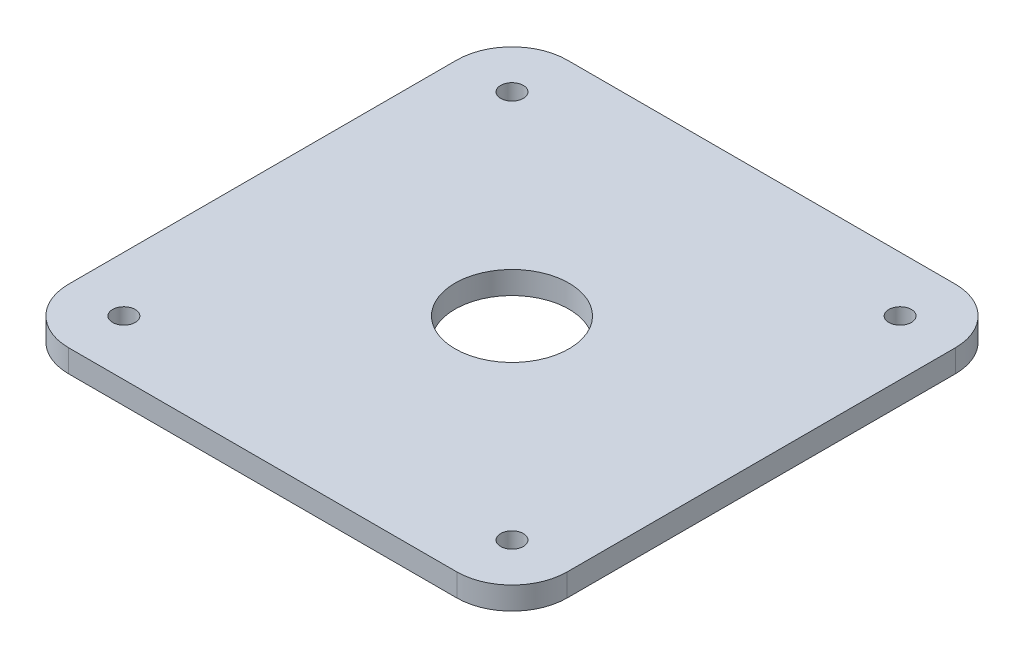
ISO-10303-21;
HEADER;
FILE_DESCRIPTION(('STEP AP214'),'2;1');
FILE_NAME('part.step','',(''),(''),'','','');
FILE_SCHEMA(('AUTOMOTIVE_DESIGN { 1 0 10303 214 1 1 1 1 }'));
ENDSEC;
DATA;
#1=APPLICATION_CONTEXT('core data for automotive mechanical design processes');
#2=APPLICATION_PROTOCOL_DEFINITION('international standard','automotive_design',2000,#1);
#3=PRODUCT_CONTEXT('',#1,'mechanical');
#4=PRODUCT('Part','Part','',(#3));
#5=PRODUCT_RELATED_PRODUCT_CATEGORY('part','',(#4));
#6=PRODUCT_DEFINITION_FORMATION('','',#4);
#7=PRODUCT_DEFINITION_CONTEXT('part definition',#1,'design');
#8=PRODUCT_DEFINITION('design','',#6,#7);
#9=PRODUCT_DEFINITION_SHAPE('','',#8);
#10=(LENGTH_UNIT() NAMED_UNIT(*) SI_UNIT(.MILLI.,.METRE.));
#11=(NAMED_UNIT(*) PLANE_ANGLE_UNIT() SI_UNIT($,.RADIAN.));
#12=(NAMED_UNIT(*) SI_UNIT($,.STERADIAN.) SOLID_ANGLE_UNIT());
#13=UNCERTAINTY_MEASURE_WITH_UNIT(LENGTH_MEASURE(1.E-05),#10,'distance_accuracy_value','');
#14=(GEOMETRIC_REPRESENTATION_CONTEXT(3) GLOBAL_UNCERTAINTY_ASSIGNED_CONTEXT((#13)) GLOBAL_UNIT_ASSIGNED_CONTEXT((#10,
#11,#12)) REPRESENTATION_CONTEXT('',''));
#15=CARTESIAN_POINT('',(0.,0.,0.));
#16=DIRECTION('',(0.,0.,1.));
#17=DIRECTION('',(1.,0.,0.));
#18=AXIS2_PLACEMENT_3D('',#15,#16,#17);
#19=CARTESIAN_POINT('',(109.,12.7,109.));
#20=DIRECTION('',(0.,1.,0.));
#21=DIRECTION('',(0.,0.,1.));
#22=AXIS2_PLACEMENT_3D('',#19,#20,#21);
#23=PLANE('',#22);
#24=CARTESIAN_POINT('',(109.,12.7,109.));
#25=DIRECTION('',(0.,1.,0.));
#26=DIRECTION('',(0.,0.,1.));
#27=AXIS2_PLACEMENT_3D('',#24,#25,#26);
#28=CIRCLE('',#27,6.34999999999999);
#29=CARTESIAN_POINT('',(109.,12.7,115.35));
#30=VERTEX_POINT('',#29);
#31=EDGE_CURVE('E194',#30,#30,#28,.T.);
#32=ORIENTED_EDGE('',*,*,#31,.F.);
#33=EDGE_LOOP('',(#32));
#34=FACE_BOUND('',#33,.T.);
#35=CARTESIAN_POINT('',(-109.,12.7,-109.));
#36=DIRECTION('',(0.,1.,0.));
#37=DIRECTION('',(0.,0.,1.));
#38=AXIS2_PLACEMENT_3D('',#35,#36,#37);
#39=CIRCLE('',#38,6.34999999999999);
#40=CARTESIAN_POINT('',(-109.,12.7,-102.65));
#41=VERTEX_POINT('',#40);
#42=EDGE_CURVE('E182',#41,#41,#39,.T.);
#43=ORIENTED_EDGE('',*,*,#42,.F.);
#44=EDGE_LOOP('',(#43));
#45=FACE_BOUND('',#44,.T.);
#46=CARTESIAN_POINT('',(109.,12.7,109.));
#47=DIRECTION('',(0.,1.,0.));
#48=DIRECTION('',(0.,0.,1.));
#49=AXIS2_PLACEMENT_3D('',#46,#47,#48);
#50=CIRCLE('',#49,31.);
#51=CARTESIAN_POINT('',(109.,12.7,140.));
#52=VERTEX_POINT('',#51);
#53=CARTESIAN_POINT('',(140.,12.7,109.));
#54=VERTEX_POINT('',#53);
#55=EDGE_CURVE('E145',#52,#54,#50,.T.);
#56=ORIENTED_EDGE('',*,*,#55,.T.);
#57=DIRECTION('',(0.,0.,-1.));
#58=VECTOR('',#57,1.);
#59=CARTESIAN_POINT('',(140.,12.7,-109.));
#60=LINE('',#59,#58);
#61=CARTESIAN_POINT('',(140.,12.7,-109.));
#62=VERTEX_POINT('',#61);
#63=EDGE_CURVE('E93',#54,#62,#60,.T.);
#64=ORIENTED_EDGE('',*,*,#63,.T.);
#65=CARTESIAN_POINT('',(109.,12.7,-109.));
#66=DIRECTION('',(0.,1.,0.));
#67=DIRECTION('',(0.,0.,-1.));
#68=AXIS2_PLACEMENT_3D('',#65,#66,#67);
#69=CIRCLE('',#68,31.);
#70=CARTESIAN_POINT('',(109.,12.7,-140.));
#71=VERTEX_POINT('',#70);
#72=EDGE_CURVE('E160',#62,#71,#69,.T.);
#73=ORIENTED_EDGE('',*,*,#72,.T.);
#74=DIRECTION('',(-1.,0.,0.));
#75=VECTOR('',#74,1.);
#76=CARTESIAN_POINT('',(-109.,12.7,-140.));
#77=LINE('',#76,#75);
#78=CARTESIAN_POINT('',(-109.,12.7,-140.));
#79=VERTEX_POINT('',#78);
#80=EDGE_CURVE('E173',#71,#79,#77,.T.);
#81=ORIENTED_EDGE('',*,*,#80,.T.);
#82=CARTESIAN_POINT('',(-109.,12.7,-109.));
#83=DIRECTION('',(0.,1.,0.));
#84=DIRECTION('',(0.,0.,1.));
#85=AXIS2_PLACEMENT_3D('',#82,#83,#84);
#86=CIRCLE('',#85,31.);
#87=CARTESIAN_POINT('',(-140.,12.7,-109.));
#88=VERTEX_POINT('',#87);
#89=EDGE_CURVE('E112',#79,#88,#86,.T.);
#90=ORIENTED_EDGE('',*,*,#89,.T.);
#91=DIRECTION('',(0.,0.,1.));
#92=VECTOR('',#91,1.);
#93=CARTESIAN_POINT('',(-140.,12.7,-109.));
#94=LINE('',#93,#92);
#95=CARTESIAN_POINT('',(-140.,12.7,109.));
#96=VERTEX_POINT('',#95);
#97=EDGE_CURVE('E106',#88,#96,#94,.T.);
#98=ORIENTED_EDGE('',*,*,#97,.T.);
#99=CARTESIAN_POINT('',(-109.,12.7,109.));
#100=DIRECTION('',(0.,1.,0.));
#101=DIRECTION('',(0.,0.,1.));
#102=AXIS2_PLACEMENT_3D('',#99,#100,#101);
#103=CIRCLE('',#102,31.);
#104=CARTESIAN_POINT('',(-109.,12.7,140.));
#105=VERTEX_POINT('',#104);
#106=EDGE_CURVE('E110',#96,#105,#103,.T.);
#107=ORIENTED_EDGE('',*,*,#106,.T.);
#108=DIRECTION('',(1.,0.,0.));
#109=VECTOR('',#108,1.);
#110=CARTESIAN_POINT('',(-109.,12.7,140.));
#111=LINE('',#110,#109);
#112=EDGE_CURVE('E50',#105,#52,#111,.T.);
#113=ORIENTED_EDGE('',*,*,#112,.T.);
#114=EDGE_LOOP('',(#56,#64,#73,#81,#90,#98,#107,#113));
#115=FACE_BOUND('',#114,.T.);
#116=CARTESIAN_POINT('',(0.,12.7,0.));
#117=DIRECTION('',(0.,1.,0.));
#118=DIRECTION('',(0.,0.,1.));
#119=AXIS2_PLACEMENT_3D('',#116,#117,#118);
#120=CIRCLE('',#119,32.);
#121=CARTESIAN_POINT('',(0.,12.7,31.9999999999999));
#122=VERTEX_POINT('',#121);
#123=EDGE_CURVE('E134',#122,#122,#120,.T.);
#124=ORIENTED_EDGE('',*,*,#123,.F.);
#125=EDGE_LOOP('',(#124));
#126=FACE_BOUND('',#125,.T.);
#127=CARTESIAN_POINT('',(109.,12.7,-109.));
#128=DIRECTION('',(0.,1.,0.));
#129=DIRECTION('',(0.,0.,1.));
#130=AXIS2_PLACEMENT_3D('',#127,#128,#129);
#131=CIRCLE('',#130,6.34999999999999);
#132=CARTESIAN_POINT('',(109.,12.7,-102.65));
#133=VERTEX_POINT('',#132);
#134=EDGE_CURVE('E188',#133,#133,#131,.T.);
#135=ORIENTED_EDGE('',*,*,#134,.F.);
#136=EDGE_LOOP('',(#135));
#137=FACE_BOUND('',#136,.T.);
#138=CARTESIAN_POINT('',(-109.,12.7,109.));
#139=DIRECTION('',(0.,1.,0.));
#140=DIRECTION('',(0.,0.,1.));
#141=AXIS2_PLACEMENT_3D('',#138,#139,#140);
#142=CIRCLE('',#141,6.34999999999999);
#143=CARTESIAN_POINT('',(-109.,12.7,115.35));
#144=VERTEX_POINT('',#143);
#145=EDGE_CURVE('E200',#144,#144,#142,.T.);
#146=ORIENTED_EDGE('',*,*,#145,.F.);
#147=EDGE_LOOP('',(#146));
#148=FACE_BOUND('',#147,.T.);
#149=ADVANCED_FACE('F33',(#34,#45,#115,#126,#137,#148),#23,.T.);
#150=CARTESIAN_POINT('',(109.,0.,109.));
#151=DIRECTION('',(0.,1.,0.));
#152=DIRECTION('',(0.,0.,1.));
#153=AXIS2_PLACEMENT_3D('',#150,#151,#152);
#154=PLANE('',#153);
#155=CARTESIAN_POINT('',(109.,0.,109.));
#156=DIRECTION('',(0.,1.,0.));
#157=DIRECTION('',(0.,0.,1.));
#158=AXIS2_PLACEMENT_3D('',#155,#156,#157);
#159=CIRCLE('',#158,6.34999999999999);
#160=CARTESIAN_POINT('',(109.,0.,115.35));
#161=VERTEX_POINT('',#160);
#162=EDGE_CURVE('E197',#161,#161,#159,.T.);
#163=ORIENTED_EDGE('',*,*,#162,.T.);
#164=EDGE_LOOP('',(#163));
#165=FACE_BOUND('',#164,.T.);
#166=CARTESIAN_POINT('',(-109.,0.,-109.));
#167=DIRECTION('',(0.,1.,0.));
#168=DIRECTION('',(0.,0.,1.));
#169=AXIS2_PLACEMENT_3D('',#166,#167,#168);
#170=CIRCLE('',#169,6.34999999999999);
#171=CARTESIAN_POINT('',(-109.,0.,-102.65));
#172=VERTEX_POINT('',#171);
#173=EDGE_CURVE('E185',#172,#172,#170,.T.);
#174=ORIENTED_EDGE('',*,*,#173,.T.);
#175=EDGE_LOOP('',(#174));
#176=FACE_BOUND('',#175,.T.);
#177=CARTESIAN_POINT('',(109.,0.,109.));
#178=DIRECTION('',(0.,1.,0.));
#179=DIRECTION('',(0.,0.,1.));
#180=AXIS2_PLACEMENT_3D('',#177,#178,#179);
#181=CIRCLE('',#180,31.);
#182=CARTESIAN_POINT('',(109.,0.,140.));
#183=VERTEX_POINT('',#182);
#184=CARTESIAN_POINT('',(140.,0.,109.));
#185=VERTEX_POINT('',#184);
#186=EDGE_CURVE('E130',#183,#185,#181,.T.);
#187=ORIENTED_EDGE('',*,*,#186,.F.);
#188=DIRECTION('',(1.,0.,0.));
#189=VECTOR('',#188,1.);
#190=CARTESIAN_POINT('',(-109.,0.,140.));
#191=LINE('',#190,#189);
#192=CARTESIAN_POINT('',(-109.,0.,140.));
#193=VERTEX_POINT('',#192);
#194=EDGE_CURVE('E85',#193,#183,#191,.T.);
#195=ORIENTED_EDGE('',*,*,#194,.F.);
#196=CARTESIAN_POINT('',(-109.,0.,109.));
#197=DIRECTION('',(0.,1.,0.));
#198=DIRECTION('',(0.,0.,1.));
#199=AXIS2_PLACEMENT_3D('',#196,#197,#198);
#200=CIRCLE('',#199,31.);
#201=CARTESIAN_POINT('',(-140.,0.,109.));
#202=VERTEX_POINT('',#201);
#203=EDGE_CURVE('E79',#202,#193,#200,.T.);
#204=ORIENTED_EDGE('',*,*,#203,.F.);
#205=DIRECTION('',(0.,0.,1.));
#206=VECTOR('',#205,1.);
#207=CARTESIAN_POINT('',(-140.,0.,-109.));
#208=LINE('',#207,#206);
#209=CARTESIAN_POINT('',(-140.,0.,-109.));
#210=VERTEX_POINT('',#209);
#211=EDGE_CURVE('E120',#210,#202,#208,.T.);
#212=ORIENTED_EDGE('',*,*,#211,.F.);
#213=CARTESIAN_POINT('',(-109.,0.,-109.));
#214=DIRECTION('',(0.,1.,0.));
#215=DIRECTION('',(0.,0.,1.));
#216=AXIS2_PLACEMENT_3D('',#213,#214,#215);
#217=CIRCLE('',#216,31.);
#218=CARTESIAN_POINT('',(-109.,0.,-140.));
#219=VERTEX_POINT('',#218);
#220=EDGE_CURVE('E140',#219,#210,#217,.T.);
#221=ORIENTED_EDGE('',*,*,#220,.F.);
#222=DIRECTION('',(-1.,0.,0.));
#223=VECTOR('',#222,1.);
#224=CARTESIAN_POINT('',(-109.,0.,-140.));
#225=LINE('',#224,#223);
#226=CARTESIAN_POINT('',(109.,0.,-140.));
#227=VERTEX_POINT('',#226);
#228=EDGE_CURVE('E138',#227,#219,#225,.T.);
#229=ORIENTED_EDGE('',*,*,#228,.F.);
#230=CARTESIAN_POINT('',(109.,0.,-109.));
#231=DIRECTION('',(0.,1.,0.));
#232=DIRECTION('',(0.,0.,-1.));
#233=AXIS2_PLACEMENT_3D('',#230,#231,#232);
#234=CIRCLE('',#233,31.);
#235=CARTESIAN_POINT('',(140.,0.,-109.));
#236=VERTEX_POINT('',#235);
#237=EDGE_CURVE('E136',#236,#227,#234,.T.);
#238=ORIENTED_EDGE('',*,*,#237,.F.);
#239=DIRECTION('',(0.,0.,-1.));
#240=VECTOR('',#239,1.);
#241=CARTESIAN_POINT('',(140.,0.,-109.));
#242=LINE('',#241,#240);
#243=EDGE_CURVE('E133',#185,#236,#242,.T.);
#244=ORIENTED_EDGE('',*,*,#243,.F.);
#245=EDGE_LOOP('',(#187,#195,#204,#212,#221,#229,#238,#244));
#246=FACE_BOUND('',#245,.T.);
#247=CARTESIAN_POINT('',(0.,0.,0.));
#248=DIRECTION('',(0.,1.,0.));
#249=DIRECTION('',(0.,0.,1.));
#250=AXIS2_PLACEMENT_3D('',#247,#248,#249);
#251=CIRCLE('',#250,32.);
#252=CARTESIAN_POINT('',(0.,0.,31.9999999999999));
#253=VERTEX_POINT('',#252);
#254=EDGE_CURVE('E179',#253,#253,#251,.T.);
#255=ORIENTED_EDGE('',*,*,#254,.T.);
#256=EDGE_LOOP('',(#255));
#257=FACE_BOUND('',#256,.T.);
#258=CARTESIAN_POINT('',(109.,0.,-109.));
#259=DIRECTION('',(0.,1.,0.));
#260=DIRECTION('',(0.,0.,1.));
#261=AXIS2_PLACEMENT_3D('',#258,#259,#260);
#262=CIRCLE('',#261,6.34999999999999);
#263=CARTESIAN_POINT('',(109.,0.,-102.65));
#264=VERTEX_POINT('',#263);
#265=EDGE_CURVE('E191',#264,#264,#262,.T.);
#266=ORIENTED_EDGE('',*,*,#265,.T.);
#267=EDGE_LOOP('',(#266));
#268=FACE_BOUND('',#267,.T.);
#269=CARTESIAN_POINT('',(-109.,0.,109.));
#270=DIRECTION('',(0.,1.,0.));
#271=DIRECTION('',(0.,0.,1.));
#272=AXIS2_PLACEMENT_3D('',#269,#270,#271);
#273=CIRCLE('',#272,6.34999999999999);
#274=CARTESIAN_POINT('',(-109.,0.,115.35));
#275=VERTEX_POINT('',#274);
#276=EDGE_CURVE('E203',#275,#275,#273,.T.);
#277=ORIENTED_EDGE('',*,*,#276,.T.);
#278=EDGE_LOOP('',(#277));
#279=FACE_BOUND('',#278,.T.);
#280=ADVANCED_FACE('F164',(#165,#176,#246,#257,#268,#279),#154,.F.);
#281=CARTESIAN_POINT('',(109.,12.7,109.));
#282=DIRECTION('',(0.,-1.,0.));
#283=DIRECTION('',(0.,0.,-1.));
#284=AXIS2_PLACEMENT_3D('',#281,#282,#283);
#285=CYLINDRICAL_SURFACE('',#284,31.);
#286=ORIENTED_EDGE('',*,*,#186,.T.);
#287=DIRECTION('',(0.,-1.,0.));
#288=VECTOR('',#287,1.);
#289=CARTESIAN_POINT('',(140.,12.7,109.));
#290=LINE('',#289,#288);
#291=EDGE_CURVE('E11',#54,#185,#290,.T.);
#292=ORIENTED_EDGE('',*,*,#291,.F.);
#293=ORIENTED_EDGE('',*,*,#55,.F.);
#294=DIRECTION('',(0.,-1.,0.));
#295=VECTOR('',#294,1.);
#296=CARTESIAN_POINT('',(109.,12.7,140.));
#297=LINE('',#296,#295);
#298=EDGE_CURVE('E126',#52,#183,#297,.T.);
#299=ORIENTED_EDGE('',*,*,#298,.T.);
#300=EDGE_LOOP('',(#286,#292,#293,#299));
#301=FACE_BOUND('',#300,.T.);
#302=ADVANCED_FACE('F35',(#301),#285,.T.);
#303=CARTESIAN_POINT('',(140.,12.7,-109.));
#304=DIRECTION('',(-1.,0.,0.));
#305=DIRECTION('',(0.,0.,1.));
#306=AXIS2_PLACEMENT_3D('',#303,#304,#305);
#307=PLANE('',#306);
#308=ORIENTED_EDGE('',*,*,#243,.T.);
#309=DIRECTION('',(0.,-1.,0.));
#310=VECTOR('',#309,1.);
#311=CARTESIAN_POINT('',(140.,12.7,-109.));
#312=LINE('',#311,#310);
#313=EDGE_CURVE('E42',#62,#236,#312,.T.);
#314=ORIENTED_EDGE('',*,*,#313,.F.);
#315=ORIENTED_EDGE('',*,*,#63,.F.);
#316=ORIENTED_EDGE('',*,*,#291,.T.);
#317=EDGE_LOOP('',(#308,#314,#315,#316));
#318=FACE_BOUND('',#317,.T.);
#319=ADVANCED_FACE('F238',(#318),#307,.F.);
#320=CARTESIAN_POINT('',(109.,12.7,-109.));
#321=DIRECTION('',(0.,-1.,0.));
#322=DIRECTION('',(0.,0.,-1.));
#323=AXIS2_PLACEMENT_3D('',#320,#321,#322);
#324=CYLINDRICAL_SURFACE('',#323,31.);
#325=ORIENTED_EDGE('',*,*,#237,.T.);
#326=DIRECTION('',(0.,-1.,0.));
#327=VECTOR('',#326,1.);
#328=CARTESIAN_POINT('',(109.,12.7,-140.));
#329=LINE('',#328,#327);
#330=EDGE_CURVE('E152',#71,#227,#329,.T.);
#331=ORIENTED_EDGE('',*,*,#330,.F.);
#332=ORIENTED_EDGE('',*,*,#72,.F.);
#333=ORIENTED_EDGE('',*,*,#313,.T.);
#334=EDGE_LOOP('',(#325,#331,#332,#333));
#335=FACE_BOUND('',#334,.T.);
#336=ADVANCED_FACE('F158',(#335),#324,.T.);
#337=CARTESIAN_POINT('',(-109.,12.7,-140.));
#338=DIRECTION('',(0.,0.,1.));
#339=DIRECTION('',(1.,0.,0.));
#340=AXIS2_PLACEMENT_3D('',#337,#338,#339);
#341=PLANE('',#340);
#342=ORIENTED_EDGE('',*,*,#228,.T.);
#343=DIRECTION('',(0.,-1.,0.));
#344=VECTOR('',#343,1.);
#345=CARTESIAN_POINT('',(-109.,12.7,-140.));
#346=LINE('',#345,#344);
#347=EDGE_CURVE('E149',#79,#219,#346,.T.);
#348=ORIENTED_EDGE('',*,*,#347,.F.);
#349=ORIENTED_EDGE('',*,*,#80,.F.);
#350=ORIENTED_EDGE('',*,*,#330,.T.);
#351=EDGE_LOOP('',(#342,#348,#349,#350));
#352=FACE_BOUND('',#351,.T.);
#353=ADVANCED_FACE('F169',(#352),#341,.F.);
#354=CARTESIAN_POINT('',(-109.,12.7,-109.));
#355=DIRECTION('',(0.,-1.,0.));
#356=DIRECTION('',(0.,0.,-1.));
#357=AXIS2_PLACEMENT_3D('',#354,#355,#356);
#358=CYLINDRICAL_SURFACE('',#357,31.);
#359=ORIENTED_EDGE('',*,*,#220,.T.);
#360=DIRECTION('',(0.,-1.,0.));
#361=VECTOR('',#360,1.);
#362=CARTESIAN_POINT('',(-140.,12.7,-109.));
#363=LINE('',#362,#361);
#364=EDGE_CURVE('E121',#88,#210,#363,.T.);
#365=ORIENTED_EDGE('',*,*,#364,.F.);
#366=ORIENTED_EDGE('',*,*,#89,.F.);
#367=ORIENTED_EDGE('',*,*,#347,.T.);
#368=EDGE_LOOP('',(#359,#365,#366,#367));
#369=FACE_BOUND('',#368,.T.);
#370=ADVANCED_FACE('F172',(#369),#358,.T.);
#371=CARTESIAN_POINT('',(-140.,12.7,-109.));
#372=DIRECTION('',(1.,0.,0.));
#373=DIRECTION('',(0.,0.,-1.));
#374=AXIS2_PLACEMENT_3D('',#371,#372,#373);
#375=PLANE('',#374);
#376=ORIENTED_EDGE('',*,*,#211,.T.);
#377=DIRECTION('',(0.,-1.,0.));
#378=VECTOR('',#377,1.);
#379=CARTESIAN_POINT('',(-140.,12.7,109.));
#380=LINE('',#379,#378);
#381=EDGE_CURVE('E117',#96,#202,#380,.T.);
#382=ORIENTED_EDGE('',*,*,#381,.F.);
#383=ORIENTED_EDGE('',*,*,#97,.F.);
#384=ORIENTED_EDGE('',*,*,#364,.T.);
#385=EDGE_LOOP('',(#376,#382,#383,#384));
#386=FACE_BOUND('',#385,.T.);
#387=ADVANCED_FACE('F118',(#386),#375,.F.);
#388=CARTESIAN_POINT('',(-109.,12.7,109.));
#389=DIRECTION('',(0.,-1.,0.));
#390=DIRECTION('',(0.,0.,-1.));
#391=AXIS2_PLACEMENT_3D('',#388,#389,#390);
#392=CYLINDRICAL_SURFACE('',#391,31.);
#393=ORIENTED_EDGE('',*,*,#203,.T.);
#394=DIRECTION('',(0.,-1.,0.));
#395=VECTOR('',#394,1.);
#396=CARTESIAN_POINT('',(-109.,12.7,140.));
#397=LINE('',#396,#395);
#398=EDGE_CURVE('E122',#105,#193,#397,.T.);
#399=ORIENTED_EDGE('',*,*,#398,.F.);
#400=ORIENTED_EDGE('',*,*,#106,.F.);
#401=ORIENTED_EDGE('',*,*,#381,.T.);
#402=EDGE_LOOP('',(#393,#399,#400,#401));
#403=FACE_BOUND('',#402,.T.);
#404=ADVANCED_FACE('F124',(#403),#392,.T.);
#405=CARTESIAN_POINT('',(-109.,12.7,140.));
#406=DIRECTION('',(0.,0.,-1.));
#407=DIRECTION('',(-1.,0.,0.));
#408=AXIS2_PLACEMENT_3D('',#405,#406,#407);
#409=PLANE('',#408);
#410=ORIENTED_EDGE('',*,*,#194,.T.);
#411=ORIENTED_EDGE('',*,*,#298,.F.);
#412=ORIENTED_EDGE('',*,*,#112,.F.);
#413=ORIENTED_EDGE('',*,*,#398,.T.);
#414=EDGE_LOOP('',(#410,#411,#412,#413));
#415=FACE_BOUND('',#414,.T.);
#416=ADVANCED_FACE('F226',(#415),#409,.F.);
#417=CARTESIAN_POINT('',(0.,12.7,0.));
#418=DIRECTION('',(0.,-1.,0.));
#419=DIRECTION('',(0.,0.,-1.));
#420=AXIS2_PLACEMENT_3D('',#417,#418,#419);
#421=CYLINDRICAL_SURFACE('',#420,32.);
#422=ORIENTED_EDGE('',*,*,#123,.T.);
#423=EDGE_LOOP('',(#422));
#424=FACE_BOUND('',#423,.T.);
#425=ORIENTED_EDGE('',*,*,#254,.F.);
#426=EDGE_LOOP('',(#425));
#427=FACE_BOUND('',#426,.T.);
#428=ADVANCED_FACE('F223',(#424,#427),#421,.F.);
#429=CARTESIAN_POINT('',(-109.,12.7,-109.));
#430=DIRECTION('',(0.,-1.,0.));
#431=DIRECTION('',(0.,0.,-1.));
#432=AXIS2_PLACEMENT_3D('',#429,#430,#431);
#433=CYLINDRICAL_SURFACE('',#432,6.34999999999999);
#434=ORIENTED_EDGE('',*,*,#42,.T.);
#435=EDGE_LOOP('',(#434));
#436=FACE_BOUND('',#435,.T.);
#437=ORIENTED_EDGE('',*,*,#173,.F.);
#438=EDGE_LOOP('',(#437));
#439=FACE_BOUND('',#438,.T.);
#440=ADVANCED_FACE('F302',(#436,#439),#433,.F.);
#441=CARTESIAN_POINT('',(109.,12.7,-109.));
#442=DIRECTION('',(0.,-1.,0.));
#443=DIRECTION('',(0.,0.,-1.));
#444=AXIS2_PLACEMENT_3D('',#441,#442,#443);
#445=CYLINDRICAL_SURFACE('',#444,6.34999999999999);
#446=ORIENTED_EDGE('',*,*,#134,.T.);
#447=EDGE_LOOP('',(#446));
#448=FACE_BOUND('',#447,.T.);
#449=ORIENTED_EDGE('',*,*,#265,.F.);
#450=EDGE_LOOP('',(#449));
#451=FACE_BOUND('',#450,.T.);
#452=ADVANCED_FACE('F310',(#448,#451),#445,.F.);
#453=CARTESIAN_POINT('',(109.,12.7,109.));
#454=DIRECTION('',(0.,-1.,0.));
#455=DIRECTION('',(0.,0.,-1.));
#456=AXIS2_PLACEMENT_3D('',#453,#454,#455);
#457=CYLINDRICAL_SURFACE('',#456,6.34999999999999);
#458=ORIENTED_EDGE('',*,*,#31,.T.);
#459=EDGE_LOOP('',(#458));
#460=FACE_BOUND('',#459,.T.);
#461=ORIENTED_EDGE('',*,*,#162,.F.);
#462=EDGE_LOOP('',(#461));
#463=FACE_BOUND('',#462,.T.);
#464=ADVANCED_FACE('F318',(#460,#463),#457,.F.);
#465=CARTESIAN_POINT('',(-109.,12.7,109.));
#466=DIRECTION('',(0.,-1.,0.));
#467=DIRECTION('',(0.,0.,-1.));
#468=AXIS2_PLACEMENT_3D('',#465,#466,#467);
#469=CYLINDRICAL_SURFACE('',#468,6.34999999999999);
#470=ORIENTED_EDGE('',*,*,#145,.T.);
#471=EDGE_LOOP('',(#470));
#472=FACE_BOUND('',#471,.T.);
#473=ORIENTED_EDGE('',*,*,#276,.F.);
#474=EDGE_LOOP('',(#473));
#475=FACE_BOUND('',#474,.T.);
#476=ADVANCED_FACE('F209',(#472,#475),#469,.F.);
#477=CLOSED_SHELL('',(#149,#280,#302,#319,#336,#353,#370,#387,#404,#416,#428,#440,#452,#464,#476));
#478=MANIFOLD_SOLID_BREP('B2',#477);
#479=ADVANCED_BREP_SHAPE_REPRESENTATION('',(#18,#478),#14);
#480=SHAPE_DEFINITION_REPRESENTATION(#9,#479);
ENDSEC;
END-ISO-10303-21;
